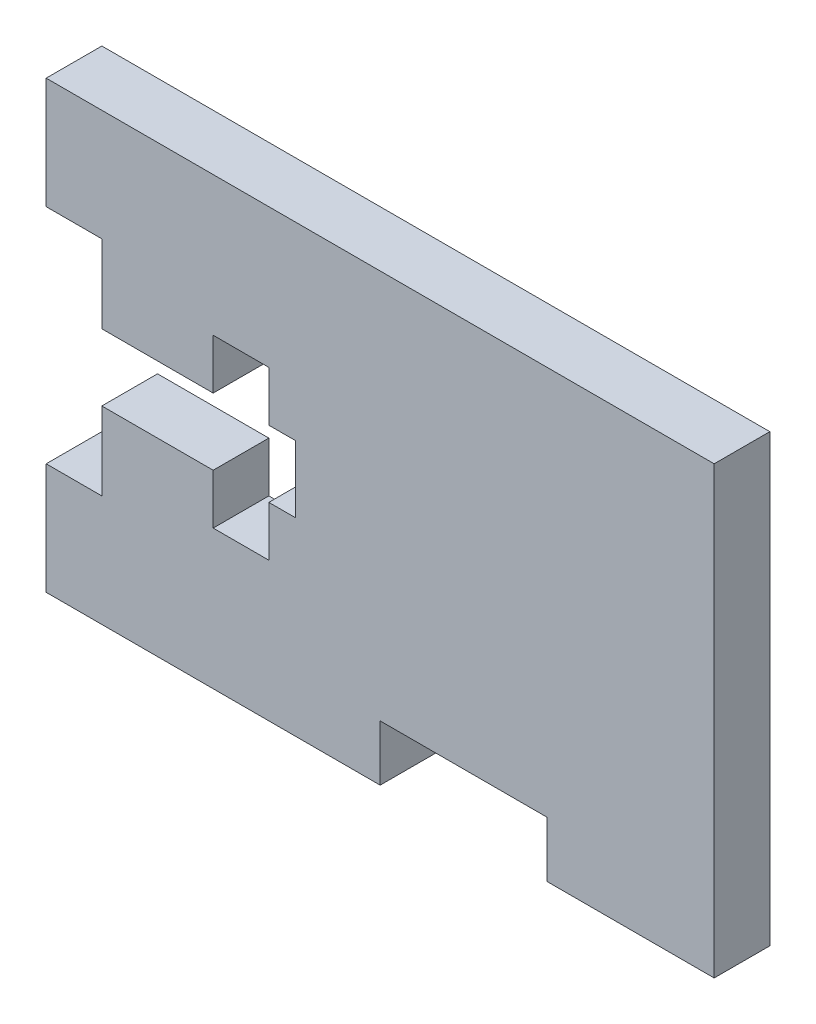
ISO-10303-21;
HEADER;
FILE_DESCRIPTION(('STEP AP214'),'2;1');
FILE_NAME('part.step','',(''),(''),'','','');
FILE_SCHEMA(('AUTOMOTIVE_DESIGN { 1 0 10303 214 1 1 1 1 }'));
ENDSEC;
DATA;
#1=APPLICATION_CONTEXT('core data for automotive mechanical design processes');
#2=APPLICATION_PROTOCOL_DEFINITION('international standard','automotive_design',2000,#1);
#3=PRODUCT_CONTEXT('',#1,'mechanical');
#4=PRODUCT('Part','Part','',(#3));
#5=PRODUCT_RELATED_PRODUCT_CATEGORY('part','',(#4));
#6=PRODUCT_DEFINITION_FORMATION('','',#4);
#7=PRODUCT_DEFINITION_CONTEXT('part definition',#1,'design');
#8=PRODUCT_DEFINITION('design','',#6,#7);
#9=PRODUCT_DEFINITION_SHAPE('','',#8);
#10=(LENGTH_UNIT() NAMED_UNIT(*) SI_UNIT(.MILLI.,.METRE.));
#11=(NAMED_UNIT(*) PLANE_ANGLE_UNIT() SI_UNIT($,.RADIAN.));
#12=(NAMED_UNIT(*) SI_UNIT($,.STERADIAN.) SOLID_ANGLE_UNIT());
#13=UNCERTAINTY_MEASURE_WITH_UNIT(LENGTH_MEASURE(1.E-05),#10,'distance_accuracy_value','');
#14=(GEOMETRIC_REPRESENTATION_CONTEXT(3) GLOBAL_UNCERTAINTY_ASSIGNED_CONTEXT((#13)) GLOBAL_UNIT_ASSIGNED_CONTEXT((#10,
#11,#12)) REPRESENTATION_CONTEXT('',''));
#15=CARTESIAN_POINT('',(0.,0.,0.));
#16=DIRECTION('',(0.,0.,1.));
#17=DIRECTION('',(1.,0.,0.));
#18=AXIS2_PLACEMENT_3D('',#15,#16,#17);
#19=CARTESIAN_POINT('',(-19.05,12.7,3.175));
#20=DIRECTION('',(1.,0.,0.));
#21=DIRECTION('',(0.,0.,-1.));
#22=AXIS2_PLACEMENT_3D('',#19,#20,#21);
#23=PLANE('',#22);
#24=DIRECTION('',(0.,-1.,0.));
#25=VECTOR('',#24,1.);
#26=CARTESIAN_POINT('',(-19.05,12.7,0.));
#27=LINE('',#26,#25);
#28=CARTESIAN_POINT('',(-19.05,12.7,0.));
#29=VERTEX_POINT('',#28);
#30=CARTESIAN_POINT('',(-19.05,6.35,0.));
#31=VERTEX_POINT('',#30);
#32=EDGE_CURVE('E225',#29,#31,#27,.T.);
#33=ORIENTED_EDGE('',*,*,#32,.T.);
#34=DIRECTION('',(0.,0.,-1.));
#35=VECTOR('',#34,1.);
#36=CARTESIAN_POINT('',(-19.05,6.35,3.175));
#37=LINE('',#36,#35);
#38=CARTESIAN_POINT('',(-19.05,6.35,3.175));
#39=VERTEX_POINT('',#38);
#40=EDGE_CURVE('E11',#39,#31,#37,.T.);
#41=ORIENTED_EDGE('',*,*,#40,.F.);
#42=DIRECTION('',(0.,-1.,0.));
#43=VECTOR('',#42,1.);
#44=CARTESIAN_POINT('',(-19.05,12.7,3.175));
#45=LINE('',#44,#43);
#46=CARTESIAN_POINT('',(-19.05,12.7,3.175));
#47=VERTEX_POINT('',#46);
#48=EDGE_CURVE('E271',#47,#39,#45,.T.);
#49=ORIENTED_EDGE('',*,*,#48,.F.);
#50=DIRECTION('',(0.,0.,-1.));
#51=VECTOR('',#50,1.);
#52=CARTESIAN_POINT('',(-19.05,12.7,3.175));
#53=LINE('',#52,#51);
#54=EDGE_CURVE('E221',#47,#29,#53,.T.);
#55=ORIENTED_EDGE('',*,*,#54,.T.);
#56=EDGE_LOOP('',(#33,#41,#49,#55));
#57=FACE_BOUND('',#56,.T.);
#58=ADVANCED_FACE('F33',(#57),#23,.F.);
#59=CARTESIAN_POINT('',(-19.05,6.35,3.175));
#60=DIRECTION('',(0.,1.,0.));
#61=DIRECTION('',(0.,0.,1.));
#62=AXIS2_PLACEMENT_3D('',#59,#60,#61);
#63=PLANE('',#62);
#64=DIRECTION('',(1.,0.,0.));
#65=VECTOR('',#64,1.);
#66=CARTESIAN_POINT('',(-19.05,6.35,0.));
#67=LINE('',#66,#65);
#68=CARTESIAN_POINT('',(-15.875,6.35,0.));
#69=VERTEX_POINT('',#68);
#70=EDGE_CURVE('E228',#31,#69,#67,.T.);
#71=ORIENTED_EDGE('',*,*,#70,.T.);
#72=DIRECTION('',(0.,0.,-1.));
#73=VECTOR('',#72,1.);
#74=CARTESIAN_POINT('',(-15.875,6.35,3.175));
#75=LINE('',#74,#73);
#76=CARTESIAN_POINT('',(-15.875,6.35,3.175));
#77=VERTEX_POINT('',#76);
#78=EDGE_CURVE('E41',#77,#69,#75,.T.);
#79=ORIENTED_EDGE('',*,*,#78,.F.);
#80=DIRECTION('',(1.,0.,0.));
#81=VECTOR('',#80,1.);
#82=CARTESIAN_POINT('',(-19.05,6.35,3.175));
#83=LINE('',#82,#81);
#84=EDGE_CURVE('E140',#39,#77,#83,.T.);
#85=ORIENTED_EDGE('',*,*,#84,.F.);
#86=ORIENTED_EDGE('',*,*,#40,.T.);
#87=EDGE_LOOP('',(#71,#79,#85,#86));
#88=FACE_BOUND('',#87,.T.);
#89=ADVANCED_FACE('F409',(#88),#63,.F.);
#90=CARTESIAN_POINT('',(-15.875,6.35,3.175));
#91=DIRECTION('',(1.,0.,0.));
#92=DIRECTION('',(0.,0.,-1.));
#93=AXIS2_PLACEMENT_3D('',#90,#91,#92);
#94=PLANE('',#93);
#95=DIRECTION('',(0.,-1.,0.));
#96=VECTOR('',#95,1.);
#97=CARTESIAN_POINT('',(-15.875,6.35,0.));
#98=LINE('',#97,#96);
#99=CARTESIAN_POINT('',(-15.875,1.905,0.));
#100=VERTEX_POINT('',#99);
#101=EDGE_CURVE('E230',#69,#100,#98,.T.);
#102=ORIENTED_EDGE('',*,*,#101,.T.);
#103=DIRECTION('',(0.,0.,-1.));
#104=VECTOR('',#103,1.);
#105=CARTESIAN_POINT('',(-15.875,1.905,3.175));
#106=LINE('',#105,#104);
#107=CARTESIAN_POINT('',(-15.875,1.905,3.175));
#108=VERTEX_POINT('',#107);
#109=EDGE_CURVE('E326',#108,#100,#106,.T.);
#110=ORIENTED_EDGE('',*,*,#109,.F.);
#111=DIRECTION('',(0.,-1.,0.));
#112=VECTOR('',#111,1.);
#113=CARTESIAN_POINT('',(-15.875,6.35,3.175));
#114=LINE('',#113,#112);
#115=EDGE_CURVE('E334',#77,#108,#114,.T.);
#116=ORIENTED_EDGE('',*,*,#115,.F.);
#117=ORIENTED_EDGE('',*,*,#78,.T.);
#118=EDGE_LOOP('',(#102,#110,#116,#117));
#119=FACE_BOUND('',#118,.T.);
#120=ADVANCED_FACE('F332',(#119),#94,.F.);
#121=CARTESIAN_POINT('',(-15.875,1.905,3.175));
#122=DIRECTION('',(0.,1.,0.));
#123=DIRECTION('',(-1.,0.,0.));
#124=AXIS2_PLACEMENT_3D('',#121,#122,#123);
#125=PLANE('',#124);
#126=DIRECTION('',(1.,0.,0.));
#127=VECTOR('',#126,1.);
#128=CARTESIAN_POINT('',(-15.875,1.905,0.));
#129=LINE('',#128,#127);
#130=CARTESIAN_POINT('',(-9.52500000000001,1.905,0.));
#131=VERTEX_POINT('',#130);
#132=EDGE_CURVE('E232',#100,#131,#129,.T.);
#133=ORIENTED_EDGE('',*,*,#132,.T.);
#134=DIRECTION('',(0.,0.,-1.));
#135=VECTOR('',#134,1.);
#136=CARTESIAN_POINT('',(-9.52500000000001,1.905,3.175));
#137=LINE('',#136,#135);
#138=CARTESIAN_POINT('',(-9.52500000000001,1.905,3.175));
#139=VERTEX_POINT('',#138);
#140=EDGE_CURVE('E323',#139,#131,#137,.T.);
#141=ORIENTED_EDGE('',*,*,#140,.F.);
#142=DIRECTION('',(1.,0.,0.));
#143=VECTOR('',#142,1.);
#144=CARTESIAN_POINT('',(-15.875,1.905,3.175));
#145=LINE('',#144,#143);
#146=EDGE_CURVE('E352',#108,#139,#145,.T.);
#147=ORIENTED_EDGE('',*,*,#146,.F.);
#148=ORIENTED_EDGE('',*,*,#109,.T.);
#149=EDGE_LOOP('',(#133,#141,#147,#148));
#150=FACE_BOUND('',#149,.T.);
#151=ADVANCED_FACE('F343',(#150),#125,.F.);
#152=CARTESIAN_POINT('',(-9.52500000000001,1.905,3.175));
#153=DIRECTION('',(-1.,0.,0.));
#154=DIRECTION('',(0.,0.,1.));
#155=AXIS2_PLACEMENT_3D('',#152,#153,#154);
#156=PLANE('',#155);
#157=DIRECTION('',(0.,1.,0.));
#158=VECTOR('',#157,1.);
#159=CARTESIAN_POINT('',(-9.52500000000001,1.905,0.));
#160=LINE('',#159,#158);
#161=CARTESIAN_POINT('',(-9.52500000000001,4.7625,0.));
#162=VERTEX_POINT('',#161);
#163=EDGE_CURVE('E234',#131,#162,#160,.T.);
#164=ORIENTED_EDGE('',*,*,#163,.T.);
#165=DIRECTION('',(0.,0.,-1.));
#166=VECTOR('',#165,1.);
#167=CARTESIAN_POINT('',(-9.52500000000001,4.7625,3.175));
#168=LINE('',#167,#166);
#169=CARTESIAN_POINT('',(-9.52500000000001,4.7625,3.175));
#170=VERTEX_POINT('',#169);
#171=EDGE_CURVE('E320',#170,#162,#168,.T.);
#172=ORIENTED_EDGE('',*,*,#171,.F.);
#173=DIRECTION('',(0.,1.,0.));
#174=VECTOR('',#173,1.);
#175=CARTESIAN_POINT('',(-9.52500000000001,1.905,3.175));
#176=LINE('',#175,#174);
#177=EDGE_CURVE('E349',#139,#170,#176,.T.);
#178=ORIENTED_EDGE('',*,*,#177,.F.);
#179=ORIENTED_EDGE('',*,*,#140,.T.);
#180=EDGE_LOOP('',(#164,#172,#178,#179));
#181=FACE_BOUND('',#180,.T.);
#182=ADVANCED_FACE('F347',(#181),#156,.F.);
#183=CARTESIAN_POINT('',(-9.52500000000001,4.7625,3.175));
#184=DIRECTION('',(0.,1.,0.));
#185=DIRECTION('',(0.,0.,1.));
#186=AXIS2_PLACEMENT_3D('',#183,#184,#185);
#187=PLANE('',#186);
#188=DIRECTION('',(1.,0.,0.));
#189=VECTOR('',#188,1.);
#190=CARTESIAN_POINT('',(-9.52500000000001,4.7625,0.));
#191=LINE('',#190,#189);
#192=CARTESIAN_POINT('',(-6.35,4.7625,0.));
#193=VERTEX_POINT('',#192);
#194=EDGE_CURVE('E236',#162,#193,#191,.T.);
#195=ORIENTED_EDGE('',*,*,#194,.T.);
#196=DIRECTION('',(0.,0.,-1.));
#197=VECTOR('',#196,1.);
#198=CARTESIAN_POINT('',(-6.35,4.7625,3.175));
#199=LINE('',#198,#197);
#200=CARTESIAN_POINT('',(-6.35,4.7625,3.175));
#201=VERTEX_POINT('',#200);
#202=EDGE_CURVE('E317',#201,#193,#199,.T.);
#203=ORIENTED_EDGE('',*,*,#202,.F.);
#204=DIRECTION('',(1.,0.,0.));
#205=VECTOR('',#204,1.);
#206=CARTESIAN_POINT('',(-9.52500000000001,4.7625,3.175));
#207=LINE('',#206,#205);
#208=EDGE_CURVE('E351',#170,#201,#207,.T.);
#209=ORIENTED_EDGE('',*,*,#208,.F.);
#210=ORIENTED_EDGE('',*,*,#171,.T.);
#211=EDGE_LOOP('',(#195,#203,#209,#210));
#212=FACE_BOUND('',#211,.T.);
#213=ADVANCED_FACE('F422',(#212),#187,.F.);
#214=CARTESIAN_POINT('',(-6.35,4.7625,3.175));
#215=DIRECTION('',(1.,0.,0.));
#216=DIRECTION('',(0.,1.,0.));
#217=AXIS2_PLACEMENT_3D('',#214,#215,#216);
#218=PLANE('',#217);
#219=DIRECTION('',(0.,-1.,0.));
#220=VECTOR('',#219,1.);
#221=CARTESIAN_POINT('',(-6.35,4.7625,0.));
#222=LINE('',#221,#220);
#223=CARTESIAN_POINT('',(-6.35,1.905,0.));
#224=VERTEX_POINT('',#223);
#225=EDGE_CURVE('E238',#193,#224,#222,.T.);
#226=ORIENTED_EDGE('',*,*,#225,.T.);
#227=DIRECTION('',(0.,0.,-1.));
#228=VECTOR('',#227,1.);
#229=CARTESIAN_POINT('',(-6.35,1.905,3.175));
#230=LINE('',#229,#228);
#231=CARTESIAN_POINT('',(-6.35,1.905,3.175));
#232=VERTEX_POINT('',#231);
#233=EDGE_CURVE('E314',#232,#224,#230,.T.);
#234=ORIENTED_EDGE('',*,*,#233,.F.);
#235=DIRECTION('',(0.,-1.,0.));
#236=VECTOR('',#235,1.);
#237=CARTESIAN_POINT('',(-6.35,4.7625,3.175));
#238=LINE('',#237,#236);
#239=EDGE_CURVE('E354',#201,#232,#238,.T.);
#240=ORIENTED_EDGE('',*,*,#239,.F.);
#241=ORIENTED_EDGE('',*,*,#202,.T.);
#242=EDGE_LOOP('',(#226,#234,#240,#241));
#243=FACE_BOUND('',#242,.T.);
#244=ADVANCED_FACE('F425',(#243),#218,.F.);
#245=CARTESIAN_POINT('',(-6.35,1.905,3.175));
#246=DIRECTION('',(0.,1.,0.));
#247=DIRECTION('',(0.,0.,1.));
#248=AXIS2_PLACEMENT_3D('',#245,#246,#247);
#249=PLANE('',#248);
#250=DIRECTION('',(1.,0.,0.));
#251=VECTOR('',#250,1.);
#252=CARTESIAN_POINT('',(-6.35,1.905,0.));
#253=LINE('',#252,#251);
#254=CARTESIAN_POINT('',(-4.826,1.905,0.));
#255=VERTEX_POINT('',#254);
#256=EDGE_CURVE('E240',#224,#255,#253,.T.);
#257=ORIENTED_EDGE('',*,*,#256,.T.);
#258=DIRECTION('',(0.,0.,-1.));
#259=VECTOR('',#258,1.);
#260=CARTESIAN_POINT('',(-4.826,1.905,3.175));
#261=LINE('',#260,#259);
#262=CARTESIAN_POINT('',(-4.826,1.905,3.175));
#263=VERTEX_POINT('',#262);
#264=EDGE_CURVE('E311',#263,#255,#261,.T.);
#265=ORIENTED_EDGE('',*,*,#264,.F.);
#266=DIRECTION('',(1.,0.,0.));
#267=VECTOR('',#266,1.);
#268=CARTESIAN_POINT('',(-6.35,1.905,3.175));
#269=LINE('',#268,#267);
#270=EDGE_CURVE('E360',#232,#263,#269,.T.);
#271=ORIENTED_EDGE('',*,*,#270,.F.);
#272=ORIENTED_EDGE('',*,*,#233,.T.);
#273=EDGE_LOOP('',(#257,#265,#271,#272));
#274=FACE_BOUND('',#273,.T.);
#275=ADVANCED_FACE('F429',(#274),#249,.F.);
#276=CARTESIAN_POINT('',(-4.826,1.905,3.175));
#277=DIRECTION('',(1.,0.,0.));
#278=DIRECTION('',(0.,0.,-1.));
#279=AXIS2_PLACEMENT_3D('',#276,#277,#278);
#280=PLANE('',#279);
#281=DIRECTION('',(0.,-1.,0.));
#282=VECTOR('',#281,1.);
#283=CARTESIAN_POINT('',(-4.826,1.905,0.));
#284=LINE('',#283,#282);
#285=CARTESIAN_POINT('',(-4.826,-1.905,0.));
#286=VERTEX_POINT('',#285);
#287=EDGE_CURVE('E242',#255,#286,#284,.T.);
#288=ORIENTED_EDGE('',*,*,#287,.T.);
#289=DIRECTION('',(0.,0.,-1.));
#290=VECTOR('',#289,1.);
#291=CARTESIAN_POINT('',(-4.826,-1.905,3.175));
#292=LINE('',#291,#290);
#293=CARTESIAN_POINT('',(-4.826,-1.905,3.175));
#294=VERTEX_POINT('',#293);
#295=EDGE_CURVE('E308',#294,#286,#292,.T.);
#296=ORIENTED_EDGE('',*,*,#295,.F.);
#297=DIRECTION('',(0.,-1.,0.));
#298=VECTOR('',#297,1.);
#299=CARTESIAN_POINT('',(-4.826,1.905,3.175));
#300=LINE('',#299,#298);
#301=EDGE_CURVE('E362',#263,#294,#300,.T.);
#302=ORIENTED_EDGE('',*,*,#301,.F.);
#303=ORIENTED_EDGE('',*,*,#264,.T.);
#304=EDGE_LOOP('',(#288,#296,#302,#303));
#305=FACE_BOUND('',#304,.T.);
#306=ADVANCED_FACE('F433',(#305),#280,.F.);
#307=CARTESIAN_POINT('',(-6.35,-1.905,3.175));
#308=DIRECTION('',(0.,-1.,0.));
#309=DIRECTION('',(0.,0.,-1.));
#310=AXIS2_PLACEMENT_3D('',#307,#308,#309);
#311=PLANE('',#310);
#312=DIRECTION('',(-1.,0.,0.));
#313=VECTOR('',#312,1.);
#314=CARTESIAN_POINT('',(-6.35,-1.905,0.));
#315=LINE('',#314,#313);
#316=CARTESIAN_POINT('',(-6.35,-1.905,0.));
#317=VERTEX_POINT('',#316);
#318=EDGE_CURVE('E244',#286,#317,#315,.T.);
#319=ORIENTED_EDGE('',*,*,#318,.T.);
#320=DIRECTION('',(0.,0.,-1.));
#321=VECTOR('',#320,1.);
#322=CARTESIAN_POINT('',(-6.35,-1.905,3.175));
#323=LINE('',#322,#321);
#324=CARTESIAN_POINT('',(-6.35,-1.905,3.175));
#325=VERTEX_POINT('',#324);
#326=EDGE_CURVE('E305',#325,#317,#323,.T.);
#327=ORIENTED_EDGE('',*,*,#326,.F.);
#328=DIRECTION('',(-1.,0.,0.));
#329=VECTOR('',#328,1.);
#330=CARTESIAN_POINT('',(-6.35,-1.905,3.175));
#331=LINE('',#330,#329);
#332=EDGE_CURVE('E364',#294,#325,#331,.T.);
#333=ORIENTED_EDGE('',*,*,#332,.F.);
#334=ORIENTED_EDGE('',*,*,#295,.T.);
#335=EDGE_LOOP('',(#319,#327,#333,#334));
#336=FACE_BOUND('',#335,.T.);
#337=ADVANCED_FACE('F437',(#336),#311,.F.);
#338=CARTESIAN_POINT('',(-6.35,-4.7625,3.175));
#339=DIRECTION('',(1.,0.,0.));
#340=DIRECTION('',(0.,1.,0.));
#341=AXIS2_PLACEMENT_3D('',#338,#339,#340);
#342=PLANE('',#341);
#343=DIRECTION('',(0.,-1.,0.));
#344=VECTOR('',#343,1.);
#345=CARTESIAN_POINT('',(-6.35,-4.7625,0.));
#346=LINE('',#345,#344);
#347=CARTESIAN_POINT('',(-6.35,-4.7625,0.));
#348=VERTEX_POINT('',#347);
#349=EDGE_CURVE('E246',#317,#348,#346,.T.);
#350=ORIENTED_EDGE('',*,*,#349,.T.);
#351=DIRECTION('',(0.,0.,-1.));
#352=VECTOR('',#351,1.);
#353=CARTESIAN_POINT('',(-6.35,-4.7625,3.175));
#354=LINE('',#353,#352);
#355=CARTESIAN_POINT('',(-6.35,-4.7625,3.175));
#356=VERTEX_POINT('',#355);
#357=EDGE_CURVE('E302',#356,#348,#354,.T.);
#358=ORIENTED_EDGE('',*,*,#357,.F.);
#359=DIRECTION('',(0.,-1.,0.));
#360=VECTOR('',#359,1.);
#361=CARTESIAN_POINT('',(-6.35,-4.7625,3.175));
#362=LINE('',#361,#360);
#363=EDGE_CURVE('E366',#325,#356,#362,.T.);
#364=ORIENTED_EDGE('',*,*,#363,.F.);
#365=ORIENTED_EDGE('',*,*,#326,.T.);
#366=EDGE_LOOP('',(#350,#358,#364,#365));
#367=FACE_BOUND('',#366,.T.);
#368=ADVANCED_FACE('F441',(#367),#342,.F.);
#369=CARTESIAN_POINT('',(-9.52500000000001,-4.7625,3.175));
#370=DIRECTION('',(0.,-1.,0.));
#371=DIRECTION('',(0.,0.,-1.));
#372=AXIS2_PLACEMENT_3D('',#369,#370,#371);
#373=PLANE('',#372);
#374=DIRECTION('',(-1.,0.,0.));
#375=VECTOR('',#374,1.);
#376=CARTESIAN_POINT('',(-9.52500000000001,-4.7625,0.));
#377=LINE('',#376,#375);
#378=CARTESIAN_POINT('',(-9.52500000000001,-4.7625,0.));
#379=VERTEX_POINT('',#378);
#380=EDGE_CURVE('E248',#348,#379,#377,.T.);
#381=ORIENTED_EDGE('',*,*,#380,.T.);
#382=DIRECTION('',(0.,0.,-1.));
#383=VECTOR('',#382,1.);
#384=CARTESIAN_POINT('',(-9.52500000000001,-4.7625,3.175));
#385=LINE('',#384,#383);
#386=CARTESIAN_POINT('',(-9.52500000000001,-4.7625,3.175));
#387=VERTEX_POINT('',#386);
#388=EDGE_CURVE('E299',#387,#379,#385,.T.);
#389=ORIENTED_EDGE('',*,*,#388,.F.);
#390=DIRECTION('',(-1.,0.,0.));
#391=VECTOR('',#390,1.);
#392=CARTESIAN_POINT('',(-9.52500000000001,-4.7625,3.175));
#393=LINE('',#392,#391);
#394=EDGE_CURVE('E368',#356,#387,#393,.T.);
#395=ORIENTED_EDGE('',*,*,#394,.F.);
#396=ORIENTED_EDGE('',*,*,#357,.T.);
#397=EDGE_LOOP('',(#381,#389,#395,#396));
#398=FACE_BOUND('',#397,.T.);
#399=ADVANCED_FACE('F445',(#398),#373,.F.);
#400=CARTESIAN_POINT('',(-9.52500000000001,-1.905,3.175));
#401=DIRECTION('',(-1.,0.,0.));
#402=DIRECTION('',(0.,0.,1.));
#403=AXIS2_PLACEMENT_3D('',#400,#401,#402);
#404=PLANE('',#403);
#405=DIRECTION('',(0.,1.,0.));
#406=VECTOR('',#405,1.);
#407=CARTESIAN_POINT('',(-9.52500000000001,-1.905,0.));
#408=LINE('',#407,#406);
#409=CARTESIAN_POINT('',(-9.52500000000001,-1.905,0.));
#410=VERTEX_POINT('',#409);
#411=EDGE_CURVE('E250',#379,#410,#408,.T.);
#412=ORIENTED_EDGE('',*,*,#411,.T.);
#413=DIRECTION('',(0.,0.,-1.));
#414=VECTOR('',#413,1.);
#415=CARTESIAN_POINT('',(-9.52500000000001,-1.905,3.175));
#416=LINE('',#415,#414);
#417=CARTESIAN_POINT('',(-9.52500000000001,-1.905,3.175));
#418=VERTEX_POINT('',#417);
#419=EDGE_CURVE('E296',#418,#410,#416,.T.);
#420=ORIENTED_EDGE('',*,*,#419,.F.);
#421=DIRECTION('',(0.,1.,0.));
#422=VECTOR('',#421,1.);
#423=CARTESIAN_POINT('',(-9.52500000000001,-1.905,3.175));
#424=LINE('',#423,#422);
#425=EDGE_CURVE('E370',#387,#418,#424,.T.);
#426=ORIENTED_EDGE('',*,*,#425,.F.);
#427=ORIENTED_EDGE('',*,*,#388,.T.);
#428=EDGE_LOOP('',(#412,#420,#426,#427));
#429=FACE_BOUND('',#428,.T.);
#430=ADVANCED_FACE('F449',(#429),#404,.F.);
#431=CARTESIAN_POINT('',(-15.875,-1.905,3.175));
#432=DIRECTION('',(0.,-1.,0.));
#433=DIRECTION('',(1.,0.,0.));
#434=AXIS2_PLACEMENT_3D('',#431,#432,#433);
#435=PLANE('',#434);
#436=DIRECTION('',(-1.,0.,0.));
#437=VECTOR('',#436,1.);
#438=CARTESIAN_POINT('',(-15.875,-1.905,0.));
#439=LINE('',#438,#437);
#440=CARTESIAN_POINT('',(-15.875,-1.905,0.));
#441=VERTEX_POINT('',#440);
#442=EDGE_CURVE('E252',#410,#441,#439,.T.);
#443=ORIENTED_EDGE('',*,*,#442,.T.);
#444=DIRECTION('',(0.,0.,-1.));
#445=VECTOR('',#444,1.);
#446=CARTESIAN_POINT('',(-15.875,-1.905,3.175));
#447=LINE('',#446,#445);
#448=CARTESIAN_POINT('',(-15.875,-1.905,3.175));
#449=VERTEX_POINT('',#448);
#450=EDGE_CURVE('E293',#449,#441,#447,.T.);
#451=ORIENTED_EDGE('',*,*,#450,.F.);
#452=DIRECTION('',(-1.,0.,0.));
#453=VECTOR('',#452,1.);
#454=CARTESIAN_POINT('',(-15.875,-1.905,3.175));
#455=LINE('',#454,#453);
#456=EDGE_CURVE('E372',#418,#449,#455,.T.);
#457=ORIENTED_EDGE('',*,*,#456,.F.);
#458=ORIENTED_EDGE('',*,*,#419,.T.);
#459=EDGE_LOOP('',(#443,#451,#457,#458));
#460=FACE_BOUND('',#459,.T.);
#461=ADVANCED_FACE('F453',(#460),#435,.F.);
#462=CARTESIAN_POINT('',(-15.875,-6.35,3.175));
#463=DIRECTION('',(1.,0.,0.));
#464=DIRECTION('',(0.,0.,-1.));
#465=AXIS2_PLACEMENT_3D('',#462,#463,#464);
#466=PLANE('',#465);
#467=DIRECTION('',(0.,-1.,0.));
#468=VECTOR('',#467,1.);
#469=CARTESIAN_POINT('',(-15.875,-6.35,0.));
#470=LINE('',#469,#468);
#471=CARTESIAN_POINT('',(-15.875,-6.35,0.));
#472=VERTEX_POINT('',#471);
#473=EDGE_CURVE('E254',#441,#472,#470,.T.);
#474=ORIENTED_EDGE('',*,*,#473,.T.);
#475=DIRECTION('',(0.,0.,-1.));
#476=VECTOR('',#475,1.);
#477=CARTESIAN_POINT('',(-15.875,-6.35,3.175));
#478=LINE('',#477,#476);
#479=CARTESIAN_POINT('',(-15.875,-6.35,3.175));
#480=VERTEX_POINT('',#479);
#481=EDGE_CURVE('E290',#480,#472,#478,.T.);
#482=ORIENTED_EDGE('',*,*,#481,.F.);
#483=DIRECTION('',(0.,-1.,0.));
#484=VECTOR('',#483,1.);
#485=CARTESIAN_POINT('',(-15.875,-6.35,3.175));
#486=LINE('',#485,#484);
#487=EDGE_CURVE('E374',#449,#480,#486,.T.);
#488=ORIENTED_EDGE('',*,*,#487,.F.);
#489=ORIENTED_EDGE('',*,*,#450,.T.);
#490=EDGE_LOOP('',(#474,#482,#488,#489));
#491=FACE_BOUND('',#490,.T.);
#492=ADVANCED_FACE('F457',(#491),#466,.F.);
#493=CARTESIAN_POINT('',(-19.05,-6.35,3.175));
#494=DIRECTION('',(0.,-1.,0.));
#495=DIRECTION('',(0.,0.,-1.));
#496=AXIS2_PLACEMENT_3D('',#493,#494,#495);
#497=PLANE('',#496);
#498=DIRECTION('',(-1.,0.,0.));
#499=VECTOR('',#498,1.);
#500=CARTESIAN_POINT('',(-19.05,-6.35,0.));
#501=LINE('',#500,#499);
#502=CARTESIAN_POINT('',(-19.05,-6.35,0.));
#503=VERTEX_POINT('',#502);
#504=EDGE_CURVE('E256',#472,#503,#501,.T.);
#505=ORIENTED_EDGE('',*,*,#504,.T.);
#506=DIRECTION('',(0.,0.,-1.));
#507=VECTOR('',#506,1.);
#508=CARTESIAN_POINT('',(-19.05,-6.35,3.175));
#509=LINE('',#508,#507);
#510=CARTESIAN_POINT('',(-19.05,-6.35,3.175));
#511=VERTEX_POINT('',#510);
#512=EDGE_CURVE('E287',#511,#503,#509,.T.);
#513=ORIENTED_EDGE('',*,*,#512,.F.);
#514=DIRECTION('',(-1.,0.,0.));
#515=VECTOR('',#514,1.);
#516=CARTESIAN_POINT('',(-19.05,-6.35,3.175));
#517=LINE('',#516,#515);
#518=EDGE_CURVE('E376',#480,#511,#517,.T.);
#519=ORIENTED_EDGE('',*,*,#518,.F.);
#520=ORIENTED_EDGE('',*,*,#481,.T.);
#521=EDGE_LOOP('',(#505,#513,#519,#520));
#522=FACE_BOUND('',#521,.T.);
#523=ADVANCED_FACE('F461',(#522),#497,.F.);
#524=CARTESIAN_POINT('',(-19.05,-6.35,3.175));
#525=DIRECTION('',(1.,0.,0.));
#526=DIRECTION('',(0.,1.,0.));
#527=AXIS2_PLACEMENT_3D('',#524,#525,#526);
#528=PLANE('',#527);
#529=DIRECTION('',(0.,-1.,0.));
#530=VECTOR('',#529,1.);
#531=CARTESIAN_POINT('',(-19.05,-6.35,0.));
#532=LINE('',#531,#530);
#533=CARTESIAN_POINT('',(-19.05,-12.7,0.));
#534=VERTEX_POINT('',#533);
#535=EDGE_CURVE('E258',#503,#534,#532,.T.);
#536=ORIENTED_EDGE('',*,*,#535,.T.);
#537=DIRECTION('',(0.,0.,-1.));
#538=VECTOR('',#537,1.);
#539=CARTESIAN_POINT('',(-19.05,-12.7,3.175));
#540=LINE('',#539,#538);
#541=CARTESIAN_POINT('',(-19.05,-12.7,3.175));
#542=VERTEX_POINT('',#541);
#543=EDGE_CURVE('E284',#542,#534,#540,.T.);
#544=ORIENTED_EDGE('',*,*,#543,.F.);
#545=DIRECTION('',(0.,-1.,0.));
#546=VECTOR('',#545,1.);
#547=CARTESIAN_POINT('',(-19.05,-6.35,3.175));
#548=LINE('',#547,#546);
#549=EDGE_CURVE('E378',#511,#542,#548,.T.);
#550=ORIENTED_EDGE('',*,*,#549,.F.);
#551=ORIENTED_EDGE('',*,*,#512,.T.);
#552=EDGE_LOOP('',(#536,#544,#550,#551));
#553=FACE_BOUND('',#552,.T.);
#554=ADVANCED_FACE('F465',(#553),#528,.F.);
#555=CARTESIAN_POINT('',(-19.05,-12.7,3.175));
#556=DIRECTION('',(0.,1.,0.));
#557=DIRECTION('',(0.,0.,1.));
#558=AXIS2_PLACEMENT_3D('',#555,#556,#557);
#559=PLANE('',#558);
#560=DIRECTION('',(1.,0.,0.));
#561=VECTOR('',#560,1.);
#562=CARTESIAN_POINT('',(-19.05,-12.7,0.));
#563=LINE('',#562,#561);
#564=CARTESIAN_POINT('',(0.,-12.7,0.));
#565=VERTEX_POINT('',#564);
#566=EDGE_CURVE('E260',#534,#565,#563,.T.);
#567=ORIENTED_EDGE('',*,*,#566,.T.);
#568=DIRECTION('',(0.,0.,-1.));
#569=VECTOR('',#568,1.);
#570=CARTESIAN_POINT('',(0.,-12.7,3.175));
#571=LINE('',#570,#569);
#572=CARTESIAN_POINT('',(0.,-12.7,3.175));
#573=VERTEX_POINT('',#572);
#574=EDGE_CURVE('E281',#573,#565,#571,.T.);
#575=ORIENTED_EDGE('',*,*,#574,.F.);
#576=DIRECTION('',(1.,0.,0.));
#577=VECTOR('',#576,1.);
#578=CARTESIAN_POINT('',(-19.05,-12.7,3.175));
#579=LINE('',#578,#577);
#580=EDGE_CURVE('E380',#542,#573,#579,.T.);
#581=ORIENTED_EDGE('',*,*,#580,.F.);
#582=ORIENTED_EDGE('',*,*,#543,.T.);
#583=EDGE_LOOP('',(#567,#575,#581,#582));
#584=FACE_BOUND('',#583,.T.);
#585=ADVANCED_FACE('F469',(#584),#559,.F.);
#586=CARTESIAN_POINT('',(0.,-12.7,3.175));
#587=DIRECTION('',(-1.,0.,0.));
#588=DIRECTION('',(0.,-1.,0.));
#589=AXIS2_PLACEMENT_3D('',#586,#587,#588);
#590=PLANE('',#589);
#591=DIRECTION('',(0.,1.,0.));
#592=VECTOR('',#591,1.);
#593=CARTESIAN_POINT('',(0.,-12.7,0.));
#594=LINE('',#593,#592);
#595=CARTESIAN_POINT('',(0.,-9.525,0.));
#596=VERTEX_POINT('',#595);
#597=EDGE_CURVE('E262',#565,#596,#594,.T.);
#598=ORIENTED_EDGE('',*,*,#597,.T.);
#599=DIRECTION('',(0.,0.,-1.));
#600=VECTOR('',#599,1.);
#601=CARTESIAN_POINT('',(0.,-9.525,3.175));
#602=LINE('',#601,#600);
#603=CARTESIAN_POINT('',(0.,-9.525,3.175));
#604=VERTEX_POINT('',#603);
#605=EDGE_CURVE('E278',#604,#596,#602,.T.);
#606=ORIENTED_EDGE('',*,*,#605,.F.);
#607=DIRECTION('',(0.,1.,0.));
#608=VECTOR('',#607,1.);
#609=CARTESIAN_POINT('',(0.,-12.7,3.175));
#610=LINE('',#609,#608);
#611=EDGE_CURVE('E382',#573,#604,#610,.T.);
#612=ORIENTED_EDGE('',*,*,#611,.F.);
#613=ORIENTED_EDGE('',*,*,#574,.T.);
#614=EDGE_LOOP('',(#598,#606,#612,#613));
#615=FACE_BOUND('',#614,.T.);
#616=ADVANCED_FACE('F473',(#615),#590,.F.);
#617=CARTESIAN_POINT('',(0.,-9.525,3.175));
#618=DIRECTION('',(0.,1.,0.));
#619=DIRECTION('',(0.,0.,1.));
#620=AXIS2_PLACEMENT_3D('',#617,#618,#619);
#621=PLANE('',#620);
#622=DIRECTION('',(1.,0.,0.));
#623=VECTOR('',#622,1.);
#624=CARTESIAN_POINT('',(0.,-9.525,0.));
#625=LINE('',#624,#623);
#626=CARTESIAN_POINT('',(9.525,-9.525,0.));
#627=VERTEX_POINT('',#626);
#628=EDGE_CURVE('E264',#596,#627,#625,.T.);
#629=ORIENTED_EDGE('',*,*,#628,.T.);
#630=DIRECTION('',(0.,0.,-1.));
#631=VECTOR('',#630,1.);
#632=CARTESIAN_POINT('',(9.525,-9.525,3.175));
#633=LINE('',#632,#631);
#634=CARTESIAN_POINT('',(9.525,-9.525,3.175));
#635=VERTEX_POINT('',#634);
#636=EDGE_CURVE('E275',#635,#627,#633,.T.);
#637=ORIENTED_EDGE('',*,*,#636,.F.);
#638=DIRECTION('',(1.,0.,0.));
#639=VECTOR('',#638,1.);
#640=CARTESIAN_POINT('',(0.,-9.525,3.175));
#641=LINE('',#640,#639);
#642=EDGE_CURVE('E384',#604,#635,#641,.T.);
#643=ORIENTED_EDGE('',*,*,#642,.F.);
#644=ORIENTED_EDGE('',*,*,#605,.T.);
#645=EDGE_LOOP('',(#629,#637,#643,#644));
#646=FACE_BOUND('',#645,.T.);
#647=ADVANCED_FACE('F390',(#646),#621,.F.);
#648=CARTESIAN_POINT('',(9.525,-9.525,3.175));
#649=DIRECTION('',(1.,0.,0.));
#650=DIRECTION('',(0.,1.,0.));
#651=AXIS2_PLACEMENT_3D('',#648,#649,#650);
#652=PLANE('',#651);
#653=DIRECTION('',(0.,-1.,0.));
#654=VECTOR('',#653,1.);
#655=CARTESIAN_POINT('',(9.525,-9.525,0.));
#656=LINE('',#655,#654);
#657=CARTESIAN_POINT('',(9.525,-12.7,0.));
#658=VERTEX_POINT('',#657);
#659=EDGE_CURVE('E266',#627,#658,#656,.T.);
#660=ORIENTED_EDGE('',*,*,#659,.T.);
#661=DIRECTION('',(0.,0.,-1.));
#662=VECTOR('',#661,1.);
#663=CARTESIAN_POINT('',(9.525,-12.7,3.175));
#664=LINE('',#663,#662);
#665=CARTESIAN_POINT('',(9.525,-12.7,3.175));
#666=VERTEX_POINT('',#665);
#667=EDGE_CURVE('E216',#666,#658,#664,.T.);
#668=ORIENTED_EDGE('',*,*,#667,.F.);
#669=DIRECTION('',(0.,-1.,0.));
#670=VECTOR('',#669,1.);
#671=CARTESIAN_POINT('',(9.525,-9.525,3.175));
#672=LINE('',#671,#670);
#673=EDGE_CURVE('E207',#635,#666,#672,.T.);
#674=ORIENTED_EDGE('',*,*,#673,.F.);
#675=ORIENTED_EDGE('',*,*,#636,.T.);
#676=EDGE_LOOP('',(#660,#668,#674,#675));
#677=FACE_BOUND('',#676,.T.);
#678=ADVANCED_FACE('F394',(#677),#652,.F.);
#679=CARTESIAN_POINT('',(9.525,-12.7,3.175));
#680=DIRECTION('',(0.,1.,0.));
#681=DIRECTION('',(0.,0.,1.));
#682=AXIS2_PLACEMENT_3D('',#679,#680,#681);
#683=PLANE('',#682);
#684=DIRECTION('',(1.,0.,0.));
#685=VECTOR('',#684,1.);
#686=CARTESIAN_POINT('',(9.525,-12.7,0.));
#687=LINE('',#686,#685);
#688=CARTESIAN_POINT('',(19.05,-12.7,0.));
#689=VERTEX_POINT('',#688);
#690=EDGE_CURVE('E215',#658,#689,#687,.T.);
#691=ORIENTED_EDGE('',*,*,#690,.T.);
#692=DIRECTION('',(0.,0.,-1.));
#693=VECTOR('',#692,1.);
#694=CARTESIAN_POINT('',(19.05,-12.7,3.175));
#695=LINE('',#694,#693);
#696=CARTESIAN_POINT('',(19.05,-12.7,3.175));
#697=VERTEX_POINT('',#696);
#698=EDGE_CURVE('E212',#697,#689,#695,.T.);
#699=ORIENTED_EDGE('',*,*,#698,.F.);
#700=DIRECTION('',(1.,0.,0.));
#701=VECTOR('',#700,1.);
#702=CARTESIAN_POINT('',(9.525,-12.7,3.175));
#703=LINE('',#702,#701);
#704=EDGE_CURVE('E201',#666,#697,#703,.T.);
#705=ORIENTED_EDGE('',*,*,#704,.F.);
#706=ORIENTED_EDGE('',*,*,#667,.T.);
#707=EDGE_LOOP('',(#691,#699,#705,#706));
#708=FACE_BOUND('',#707,.T.);
#709=ADVANCED_FACE('F213',(#708),#683,.F.);
#710=CARTESIAN_POINT('',(19.05,12.7,3.175));
#711=DIRECTION('',(-1.,0.,0.));
#712=DIRECTION('',(0.,0.,1.));
#713=AXIS2_PLACEMENT_3D('',#710,#711,#712);
#714=PLANE('',#713);
#715=DIRECTION('',(0.,1.,0.));
#716=VECTOR('',#715,1.);
#717=CARTESIAN_POINT('',(19.05,12.7,0.));
#718=LINE('',#717,#716);
#719=CARTESIAN_POINT('',(19.05,12.7,0.));
#720=VERTEX_POINT('',#719);
#721=EDGE_CURVE('E126',#689,#720,#718,.T.);
#722=ORIENTED_EDGE('',*,*,#721,.T.);
#723=DIRECTION('',(0.,0.,-1.));
#724=VECTOR('',#723,1.);
#725=CARTESIAN_POINT('',(19.05,12.7,3.175));
#726=LINE('',#725,#724);
#727=CARTESIAN_POINT('',(19.05,12.7,3.175));
#728=VERTEX_POINT('',#727);
#729=EDGE_CURVE('E217',#728,#720,#726,.T.);
#730=ORIENTED_EDGE('',*,*,#729,.F.);
#731=DIRECTION('',(0.,1.,0.));
#732=VECTOR('',#731,1.);
#733=CARTESIAN_POINT('',(19.05,12.7,3.175));
#734=LINE('',#733,#732);
#735=EDGE_CURVE('E205',#697,#728,#734,.T.);
#736=ORIENTED_EDGE('',*,*,#735,.F.);
#737=ORIENTED_EDGE('',*,*,#698,.T.);
#738=EDGE_LOOP('',(#722,#730,#736,#737));
#739=FACE_BOUND('',#738,.T.);
#740=ADVANCED_FACE('F219',(#739),#714,.F.);
#741=CARTESIAN_POINT('',(-19.05,12.7,3.175));
#742=DIRECTION('',(0.,-1.,0.));
#743=DIRECTION('',(0.,0.,-1.));
#744=AXIS2_PLACEMENT_3D('',#741,#742,#743);
#745=PLANE('',#744);
#746=DIRECTION('',(-1.,0.,0.));
#747=VECTOR('',#746,1.);
#748=CARTESIAN_POINT('',(-19.05,12.7,0.));
#749=LINE('',#748,#747);
#750=EDGE_CURVE('E132',#720,#29,#749,.T.);
#751=ORIENTED_EDGE('',*,*,#750,.T.);
#752=ORIENTED_EDGE('',*,*,#54,.F.);
#753=DIRECTION('',(-1.,0.,0.));
#754=VECTOR('',#753,1.);
#755=CARTESIAN_POINT('',(-19.05,12.7,3.175));
#756=LINE('',#755,#754);
#757=EDGE_CURVE('E49',#728,#47,#756,.T.);
#758=ORIENTED_EDGE('',*,*,#757,.F.);
#759=ORIENTED_EDGE('',*,*,#729,.T.);
#760=EDGE_LOOP('',(#751,#752,#758,#759));
#761=FACE_BOUND('',#760,.T.);
#762=ADVANCED_FACE('F398',(#761),#745,.F.);
#763=CARTESIAN_POINT('',(0.,0.,3.175));
#764=DIRECTION('',(0.,0.,1.));
#765=DIRECTION('',(1.,0.,0.));
#766=AXIS2_PLACEMENT_3D('',#763,#764,#765);
#767=PLANE('',#766);
#768=ORIENTED_EDGE('',*,*,#48,.T.);
#769=ORIENTED_EDGE('',*,*,#84,.T.);
#770=ORIENTED_EDGE('',*,*,#115,.T.);
#771=ORIENTED_EDGE('',*,*,#146,.T.);
#772=ORIENTED_EDGE('',*,*,#177,.T.);
#773=ORIENTED_EDGE('',*,*,#208,.T.);
#774=ORIENTED_EDGE('',*,*,#239,.T.);
#775=ORIENTED_EDGE('',*,*,#270,.T.);
#776=ORIENTED_EDGE('',*,*,#301,.T.);
#777=ORIENTED_EDGE('',*,*,#332,.T.);
#778=ORIENTED_EDGE('',*,*,#363,.T.);
#779=ORIENTED_EDGE('',*,*,#394,.T.);
#780=ORIENTED_EDGE('',*,*,#425,.T.);
#781=ORIENTED_EDGE('',*,*,#456,.T.);
#782=ORIENTED_EDGE('',*,*,#487,.T.);
#783=ORIENTED_EDGE('',*,*,#518,.T.);
#784=ORIENTED_EDGE('',*,*,#549,.T.);
#785=ORIENTED_EDGE('',*,*,#580,.T.);
#786=ORIENTED_EDGE('',*,*,#611,.T.);
#787=ORIENTED_EDGE('',*,*,#642,.T.);
#788=ORIENTED_EDGE('',*,*,#673,.T.);
#789=ORIENTED_EDGE('',*,*,#704,.T.);
#790=ORIENTED_EDGE('',*,*,#735,.T.);
#791=ORIENTED_EDGE('',*,*,#757,.T.);
#792=EDGE_LOOP('',(#768,#769,#770,#771,#772,#773,#774,#775,#776,#777,#778,#779,#780,#781,#782,
#783,#784,#785,#786,#787,#788,#789,#790,#791));
#793=FACE_BOUND('',#792,.T.);
#794=ADVANCED_FACE('F203',(#793),#767,.T.);
#795=CARTESIAN_POINT('',(0.,0.,0.));
#796=DIRECTION('',(0.,0.,1.));
#797=DIRECTION('',(1.,0.,0.));
#798=AXIS2_PLACEMENT_3D('',#795,#796,#797);
#799=PLANE('',#798);
#800=ORIENTED_EDGE('',*,*,#32,.F.);
#801=ORIENTED_EDGE('',*,*,#750,.F.);
#802=ORIENTED_EDGE('',*,*,#721,.F.);
#803=ORIENTED_EDGE('',*,*,#690,.F.);
#804=ORIENTED_EDGE('',*,*,#659,.F.);
#805=ORIENTED_EDGE('',*,*,#628,.F.);
#806=ORIENTED_EDGE('',*,*,#597,.F.);
#807=ORIENTED_EDGE('',*,*,#566,.F.);
#808=ORIENTED_EDGE('',*,*,#535,.F.);
#809=ORIENTED_EDGE('',*,*,#504,.F.);
#810=ORIENTED_EDGE('',*,*,#473,.F.);
#811=ORIENTED_EDGE('',*,*,#442,.F.);
#812=ORIENTED_EDGE('',*,*,#411,.F.);
#813=ORIENTED_EDGE('',*,*,#380,.F.);
#814=ORIENTED_EDGE('',*,*,#349,.F.);
#815=ORIENTED_EDGE('',*,*,#318,.F.);
#816=ORIENTED_EDGE('',*,*,#287,.F.);
#817=ORIENTED_EDGE('',*,*,#256,.F.);
#818=ORIENTED_EDGE('',*,*,#225,.F.);
#819=ORIENTED_EDGE('',*,*,#194,.F.);
#820=ORIENTED_EDGE('',*,*,#163,.F.);
#821=ORIENTED_EDGE('',*,*,#132,.F.);
#822=ORIENTED_EDGE('',*,*,#101,.F.);
#823=ORIENTED_EDGE('',*,*,#70,.F.);
#824=EDGE_LOOP('',(#800,#801,#802,#803,#804,#805,#806,#807,#808,#809,#810,#811,#812,#813,#814,
#815,#816,#817,#818,#819,#820,#821,#822,#823));
#825=FACE_BOUND('',#824,.T.);
#826=ADVANCED_FACE('F338',(#825),#799,.F.);
#827=CLOSED_SHELL('',(#58,#89,#120,#151,#182,#213,#244,#275,#306,#337,#368,#399,#430,#461,#492,
#523,#554,#585,#616,#647,#678,#709,#740,#762,#794,#826));
#828=MANIFOLD_SOLID_BREP('B2',#827);
#829=ADVANCED_BREP_SHAPE_REPRESENTATION('',(#18,#828),#14);
#830=SHAPE_DEFINITION_REPRESENTATION(#9,#829);
ENDSEC;
END-ISO-10303-21;
